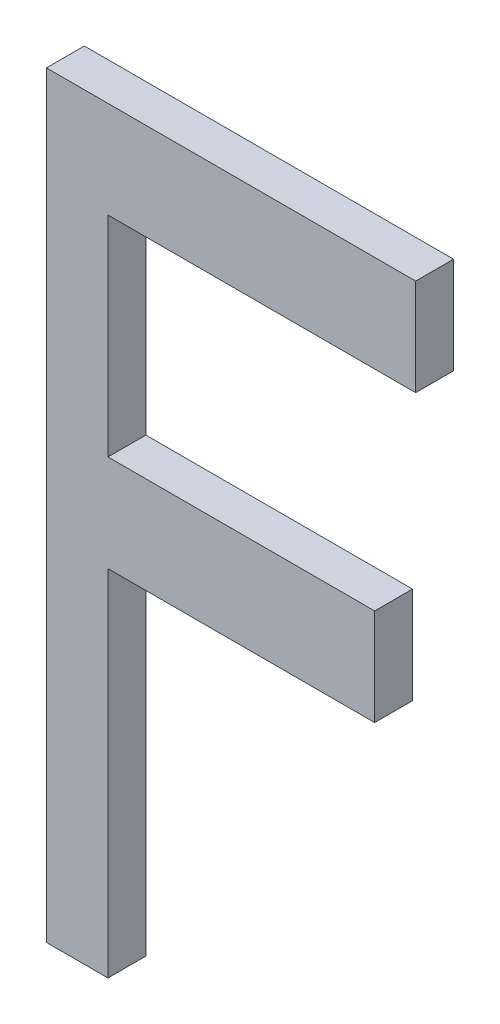
ISO-10303-21;
HEADER;
FILE_DESCRIPTION(('STEP AP214'),'2;1');
FILE_NAME('part.step','',(''),(''),'','','');
FILE_SCHEMA(('AUTOMOTIVE_DESIGN { 1 0 10303 214 1 1 1 1 }'));
ENDSEC;
DATA;
#1=APPLICATION_CONTEXT('core data for automotive mechanical design processes');
#2=APPLICATION_PROTOCOL_DEFINITION('international standard','automotive_design',2000,#1);
#3=PRODUCT_CONTEXT('',#1,'mechanical');
#4=PRODUCT('Part','Part','',(#3));
#5=PRODUCT_RELATED_PRODUCT_CATEGORY('part','',(#4));
#6=PRODUCT_DEFINITION_FORMATION('','',#4);
#7=PRODUCT_DEFINITION_CONTEXT('part definition',#1,'design');
#8=PRODUCT_DEFINITION('design','',#6,#7);
#9=PRODUCT_DEFINITION_SHAPE('','',#8);
#10=(LENGTH_UNIT() NAMED_UNIT(*) SI_UNIT(.MILLI.,.METRE.));
#11=(NAMED_UNIT(*) PLANE_ANGLE_UNIT() SI_UNIT($,.RADIAN.));
#12=(NAMED_UNIT(*) SI_UNIT($,.STERADIAN.) SOLID_ANGLE_UNIT());
#13=UNCERTAINTY_MEASURE_WITH_UNIT(LENGTH_MEASURE(1.E-05),#10,'distance_accuracy_value','');
#14=(GEOMETRIC_REPRESENTATION_CONTEXT(3) GLOBAL_UNCERTAINTY_ASSIGNED_CONTEXT((#13)) GLOBAL_UNIT_ASSIGNED_CONTEXT((#10,
#11,#12)) REPRESENTATION_CONTEXT('',''));
#15=CARTESIAN_POINT('',(0.,0.,0.));
#16=DIRECTION('',(0.,0.,1.));
#17=DIRECTION('',(1.,0.,0.));
#18=AXIS2_PLACEMENT_3D('',#15,#16,#17);
#19=CARTESIAN_POINT('',(109.664831113507,28.2906710184783,5.9));
#20=DIRECTION('',(0.,0.,1.));
#21=DIRECTION('',(1.,0.,0.));
#22=AXIS2_PLACEMENT_3D('',#19,#20,#21);
#23=PLANE('',#22);
#24=DIRECTION('',(1.,0.,0.));
#25=VECTOR('',#24,1.);
#26=CARTESIAN_POINT('',(109.664831113507,30.2906710184783,5.9));
#27=LINE('',#26,#25);
#28=CARTESIAN_POINT('',(110.639831113507,30.2906710184783,5.9));
#29=VERTEX_POINT('',#28);
#30=CARTESIAN_POINT('',(109.664831113507,30.2906710184783,5.9));
#31=VERTEX_POINT('',#30);
#32=EDGE_CURVE('E126',#29,#31,#27,.F.);
#33=ORIENTED_EDGE('',*,*,#32,.F.);
#34=DIRECTION('',(0.,1.,0.));
#35=VECTOR('',#34,1.);
#36=CARTESIAN_POINT('',(110.639831113507,28.2906710184783,5.9));
#37=LINE('',#36,#35);
#38=CARTESIAN_POINT('',(110.639831113507,30.0353518999783,5.9));
#39=VERTEX_POINT('',#38);
#40=EDGE_CURVE('E124',#39,#29,#37,.T.);
#41=ORIENTED_EDGE('',*,*,#40,.F.);
#42=DIRECTION('',(1.,0.,0.));
#43=VECTOR('',#42,1.);
#44=CARTESIAN_POINT('',(109.664831113507,30.0353518999783,5.9));
#45=LINE('',#44,#43);
#46=CARTESIAN_POINT('',(109.827331113507,30.0353518999783,5.9));
#47=VERTEX_POINT('',#46);
#48=EDGE_CURVE('E122',#47,#39,#45,.T.);
#49=ORIENTED_EDGE('',*,*,#48,.F.);
#50=DIRECTION('',(0.,1.,0.));
#51=VECTOR('',#50,1.);
#52=CARTESIAN_POINT('',(109.827331113507,28.2906710184783,5.9));
#53=LINE('',#52,#51);
#54=CARTESIAN_POINT('',(109.827331113507,29.4821603573583,5.9));
#55=VERTEX_POINT('',#54);
#56=EDGE_CURVE('E120',#55,#47,#53,.T.);
#57=ORIENTED_EDGE('',*,*,#56,.F.);
#58=DIRECTION('',(1.,0.,0.));
#59=VECTOR('',#58,1.);
#60=CARTESIAN_POINT('',(109.664831113507,29.4821603573583,5.9));
#61=LINE('',#60,#59);
#62=CARTESIAN_POINT('',(110.531497806007,29.4821603573583,5.9));
#63=VERTEX_POINT('',#62);
#64=EDGE_CURVE('E118',#63,#55,#61,.F.);
#65=ORIENTED_EDGE('',*,*,#64,.F.);
#66=DIRECTION('',(0.,1.,0.));
#67=VECTOR('',#66,1.);
#68=CARTESIAN_POINT('',(110.531497806007,28.2906710184783,5.9));
#69=LINE('',#68,#67);
#70=CARTESIAN_POINT('',(110.531497806007,29.2268412388583,5.9));
#71=VERTEX_POINT('',#70);
#72=EDGE_CURVE('E114',#71,#63,#69,.T.);
#73=ORIENTED_EDGE('',*,*,#72,.F.);
#74=DIRECTION('',(1.,0.,0.));
#75=VECTOR('',#74,1.);
#76=CARTESIAN_POINT('',(109.664831113507,29.2268412388583,5.9));
#77=LINE('',#76,#75);
#78=CARTESIAN_POINT('',(109.827331113507,29.2268412388583,5.9));
#79=VERTEX_POINT('',#78);
#80=EDGE_CURVE('E113',#79,#71,#77,.T.);
#81=ORIENTED_EDGE('',*,*,#80,.F.);
#82=DIRECTION('',(0.,1.,0.));
#83=VECTOR('',#82,1.);
#84=CARTESIAN_POINT('',(109.827331113507,28.2906710184783,5.9));
#85=LINE('',#84,#83);
#86=CARTESIAN_POINT('',(109.827331113507,28.2906710184783,5.9));
#87=VERTEX_POINT('',#86);
#88=EDGE_CURVE('E91',#87,#79,#85,.T.);
#89=ORIENTED_EDGE('',*,*,#88,.F.);
#90=DIRECTION('',(1.,0.,0.));
#91=VECTOR('',#90,1.);
#92=CARTESIAN_POINT('',(109.664831113507,28.2906710184783,5.9));
#93=LINE('',#92,#91);
#94=CARTESIAN_POINT('',(109.664831113507,28.2906710184783,5.9));
#95=VERTEX_POINT('',#94);
#96=EDGE_CURVE('E20',#95,#87,#93,.T.);
#97=ORIENTED_EDGE('',*,*,#96,.F.);
#98=DIRECTION('',(0.,1.,0.));
#99=VECTOR('',#98,1.);
#100=CARTESIAN_POINT('',(109.664831113507,30.2906710184783,5.9));
#101=LINE('',#100,#99);
#102=EDGE_CURVE('E128',#95,#31,#101,.T.);
#103=ORIENTED_EDGE('',*,*,#102,.T.);
#104=EDGE_LOOP('',(#33,#41,#49,#57,#65,#73,#81,#89,#97,#103));
#105=FACE_BOUND('',#104,.T.);
#106=ADVANCED_FACE('F17',(#105),#23,.F.);
#107=CARTESIAN_POINT('',(109.664831113507,30.2906710184783,6.));
#108=DIRECTION('',(1.,0.,0.));
#109=DIRECTION('',(0.,0.,-1.));
#110=AXIS2_PLACEMENT_3D('',#107,#108,#109);
#111=PLANE('',#110);
#112=DIRECTION('',(0.,0.,1.));
#113=VECTOR('',#112,1.);
#114=CARTESIAN_POINT('',(109.664831113507,28.2906710184783,6.));
#115=LINE('',#114,#113);
#116=CARTESIAN_POINT('',(109.664831113507,28.2906710184783,6.));
#117=VERTEX_POINT('',#116);
#118=EDGE_CURVE('E100',#95,#117,#115,.T.);
#119=ORIENTED_EDGE('',*,*,#118,.T.);
#120=DIRECTION('',(0.,1.,0.));
#121=VECTOR('',#120,1.);
#122=CARTESIAN_POINT('',(109.664831113507,28.2906710184783,6.));
#123=LINE('',#122,#121);
#124=CARTESIAN_POINT('',(109.664831113507,30.2906710184783,6.));
#125=VERTEX_POINT('',#124);
#126=EDGE_CURVE('E146',#125,#117,#123,.F.);
#127=ORIENTED_EDGE('',*,*,#126,.F.);
#128=DIRECTION('',(0.,0.,-1.));
#129=VECTOR('',#128,1.);
#130=CARTESIAN_POINT('',(109.664831113507,30.2906710184783,6.));
#131=LINE('',#130,#129);
#132=EDGE_CURVE('E143',#125,#31,#131,.T.);
#133=ORIENTED_EDGE('',*,*,#132,.T.);
#134=ORIENTED_EDGE('',*,*,#102,.F.);
#135=EDGE_LOOP('',(#119,#127,#133,#134));
#136=FACE_BOUND('',#135,.T.);
#137=ADVANCED_FACE('F181',(#136),#111,.F.);
#138=CARTESIAN_POINT('',(109.664831113507,28.2906710184783,6.));
#139=DIRECTION('',(0.,1.,0.));
#140=DIRECTION('',(0.,0.,1.));
#141=AXIS2_PLACEMENT_3D('',#138,#139,#140);
#142=PLANE('',#141);
#143=DIRECTION('',(0.,0.,1.));
#144=VECTOR('',#143,1.);
#145=CARTESIAN_POINT('',(109.827331113507,28.2906710184783,6.));
#146=LINE('',#145,#144);
#147=CARTESIAN_POINT('',(109.827331113507,28.2906710184783,6.));
#148=VERTEX_POINT('',#147);
#149=EDGE_CURVE('E98',#87,#148,#146,.T.);
#150=ORIENTED_EDGE('',*,*,#149,.T.);
#151=DIRECTION('',(1.,0.,0.));
#152=VECTOR('',#151,1.);
#153=CARTESIAN_POINT('',(109.664831113507,28.2906710184783,6.));
#154=LINE('',#153,#152);
#155=EDGE_CURVE('E149',#117,#148,#154,.T.);
#156=ORIENTED_EDGE('',*,*,#155,.F.);
#157=ORIENTED_EDGE('',*,*,#118,.F.);
#158=ORIENTED_EDGE('',*,*,#96,.T.);
#159=EDGE_LOOP('',(#150,#156,#157,#158));
#160=FACE_BOUND('',#159,.T.);
#161=ADVANCED_FACE('F96',(#160),#142,.F.);
#162=CARTESIAN_POINT('',(109.827331113507,28.2906710184783,6.));
#163=DIRECTION('',(-1.,0.,0.));
#164=DIRECTION('',(0.,0.,1.));
#165=AXIS2_PLACEMENT_3D('',#162,#163,#164);
#166=PLANE('',#165);
#167=DIRECTION('',(0.,0.,1.));
#168=VECTOR('',#167,1.);
#169=CARTESIAN_POINT('',(109.827331113507,29.2268412388583,6.));
#170=LINE('',#169,#168);
#171=CARTESIAN_POINT('',(109.827331113507,29.2268412388583,6.));
#172=VERTEX_POINT('',#171);
#173=EDGE_CURVE('E108',#79,#172,#170,.T.);
#174=ORIENTED_EDGE('',*,*,#173,.T.);
#175=DIRECTION('',(0.,1.,0.));
#176=VECTOR('',#175,1.);
#177=CARTESIAN_POINT('',(109.827331113507,28.2906710184783,6.));
#178=LINE('',#177,#176);
#179=EDGE_CURVE('E106',#148,#172,#178,.T.);
#180=ORIENTED_EDGE('',*,*,#179,.F.);
#181=ORIENTED_EDGE('',*,*,#149,.F.);
#182=ORIENTED_EDGE('',*,*,#88,.T.);
#183=EDGE_LOOP('',(#174,#180,#181,#182));
#184=FACE_BOUND('',#183,.T.);
#185=ADVANCED_FACE('F104',(#184),#166,.F.);
#186=CARTESIAN_POINT('',(109.827331113507,29.2268412388583,6.));
#187=DIRECTION('',(0.,1.,0.));
#188=DIRECTION('',(0.,0.,1.));
#189=AXIS2_PLACEMENT_3D('',#186,#187,#188);
#190=PLANE('',#189);
#191=DIRECTION('',(0.,0.,1.));
#192=VECTOR('',#191,1.);
#193=CARTESIAN_POINT('',(110.531497806007,29.2268412388583,6.));
#194=LINE('',#193,#192);
#195=CARTESIAN_POINT('',(110.531497806007,29.2268412388583,6.));
#196=VERTEX_POINT('',#195);
#197=EDGE_CURVE('E132',#71,#196,#194,.T.);
#198=ORIENTED_EDGE('',*,*,#197,.T.);
#199=DIRECTION('',(1.,0.,0.));
#200=VECTOR('',#199,1.);
#201=CARTESIAN_POINT('',(109.664831113507,29.2268412388583,6.));
#202=LINE('',#201,#200);
#203=EDGE_CURVE('E152',#172,#196,#202,.T.);
#204=ORIENTED_EDGE('',*,*,#203,.F.);
#205=ORIENTED_EDGE('',*,*,#173,.F.);
#206=ORIENTED_EDGE('',*,*,#80,.T.);
#207=EDGE_LOOP('',(#198,#204,#205,#206));
#208=FACE_BOUND('',#207,.T.);
#209=ADVANCED_FACE('F185',(#208),#190,.F.);
#210=CARTESIAN_POINT('',(110.531497806007,29.2268412388583,6.));
#211=DIRECTION('',(-1.,0.,0.));
#212=DIRECTION('',(0.,0.,1.));
#213=AXIS2_PLACEMENT_3D('',#210,#211,#212);
#214=PLANE('',#213);
#215=DIRECTION('',(0.,0.,-1.));
#216=VECTOR('',#215,1.);
#217=CARTESIAN_POINT('',(110.531497806007,29.4821603573583,6.));
#218=LINE('',#217,#216);
#219=CARTESIAN_POINT('',(110.531497806007,29.4821603573583,6.));
#220=VERTEX_POINT('',#219);
#221=EDGE_CURVE('E134',#63,#220,#218,.F.);
#222=ORIENTED_EDGE('',*,*,#221,.T.);
#223=DIRECTION('',(0.,1.,0.));
#224=VECTOR('',#223,1.);
#225=CARTESIAN_POINT('',(110.531497806007,28.2906710184783,6.));
#226=LINE('',#225,#224);
#227=EDGE_CURVE('E155',#196,#220,#226,.T.);
#228=ORIENTED_EDGE('',*,*,#227,.F.);
#229=ORIENTED_EDGE('',*,*,#197,.F.);
#230=ORIENTED_EDGE('',*,*,#72,.T.);
#231=EDGE_LOOP('',(#222,#228,#229,#230));
#232=FACE_BOUND('',#231,.T.);
#233=ADVANCED_FACE('F188',(#232),#214,.F.);
#234=CARTESIAN_POINT('',(110.531497806007,29.4821603573583,6.));
#235=DIRECTION('',(0.,-1.,0.));
#236=DIRECTION('',(0.,0.,-1.));
#237=AXIS2_PLACEMENT_3D('',#234,#235,#236);
#238=PLANE('',#237);
#239=DIRECTION('',(0.,0.,1.));
#240=VECTOR('',#239,1.);
#241=CARTESIAN_POINT('',(109.827331113507,29.4821603573583,6.));
#242=LINE('',#241,#240);
#243=CARTESIAN_POINT('',(109.827331113507,29.4821603573583,6.));
#244=VERTEX_POINT('',#243);
#245=EDGE_CURVE('E136',#55,#244,#242,.T.);
#246=ORIENTED_EDGE('',*,*,#245,.T.);
#247=DIRECTION('',(1.,0.,0.));
#248=VECTOR('',#247,1.);
#249=CARTESIAN_POINT('',(109.664831113507,29.4821603573583,6.));
#250=LINE('',#249,#248);
#251=EDGE_CURVE('E158',#220,#244,#250,.F.);
#252=ORIENTED_EDGE('',*,*,#251,.F.);
#253=ORIENTED_EDGE('',*,*,#221,.F.);
#254=ORIENTED_EDGE('',*,*,#64,.T.);
#255=EDGE_LOOP('',(#246,#252,#253,#254));
#256=FACE_BOUND('',#255,.T.);
#257=ADVANCED_FACE('F193',(#256),#238,.F.);
#258=CARTESIAN_POINT('',(109.827331113507,29.4821603573583,6.));
#259=DIRECTION('',(-1.,0.,0.));
#260=DIRECTION('',(0.,0.,1.));
#261=AXIS2_PLACEMENT_3D('',#258,#259,#260);
#262=PLANE('',#261);
#263=DIRECTION('',(0.,0.,1.));
#264=VECTOR('',#263,1.);
#265=CARTESIAN_POINT('',(109.827331113507,30.0353518999783,6.));
#266=LINE('',#265,#264);
#267=CARTESIAN_POINT('',(109.827331113507,30.0353518999783,6.));
#268=VERTEX_POINT('',#267);
#269=EDGE_CURVE('E138',#47,#268,#266,.T.);
#270=ORIENTED_EDGE('',*,*,#269,.T.);
#271=DIRECTION('',(0.,1.,0.));
#272=VECTOR('',#271,1.);
#273=CARTESIAN_POINT('',(109.827331113507,28.2906710184783,6.));
#274=LINE('',#273,#272);
#275=EDGE_CURVE('E161',#244,#268,#274,.T.);
#276=ORIENTED_EDGE('',*,*,#275,.F.);
#277=ORIENTED_EDGE('',*,*,#245,.F.);
#278=ORIENTED_EDGE('',*,*,#56,.T.);
#279=EDGE_LOOP('',(#270,#276,#277,#278));
#280=FACE_BOUND('',#279,.T.);
#281=ADVANCED_FACE('F197',(#280),#262,.F.);
#282=CARTESIAN_POINT('',(109.827331113507,30.0353518999783,6.));
#283=DIRECTION('',(0.,1.,0.));
#284=DIRECTION('',(0.,0.,1.));
#285=AXIS2_PLACEMENT_3D('',#282,#283,#284);
#286=PLANE('',#285);
#287=DIRECTION('',(0.,0.,1.));
#288=VECTOR('',#287,1.);
#289=CARTESIAN_POINT('',(110.639831113507,30.0353518999783,6.));
#290=LINE('',#289,#288);
#291=CARTESIAN_POINT('',(110.639831113507,30.0353518999783,6.));
#292=VERTEX_POINT('',#291);
#293=EDGE_CURVE('E140',#39,#292,#290,.T.);
#294=ORIENTED_EDGE('',*,*,#293,.T.);
#295=DIRECTION('',(1.,0.,0.));
#296=VECTOR('',#295,1.);
#297=CARTESIAN_POINT('',(109.664831113507,30.0353518999783,6.));
#298=LINE('',#297,#296);
#299=EDGE_CURVE('E164',#268,#292,#298,.T.);
#300=ORIENTED_EDGE('',*,*,#299,.F.);
#301=ORIENTED_EDGE('',*,*,#269,.F.);
#302=ORIENTED_EDGE('',*,*,#48,.T.);
#303=EDGE_LOOP('',(#294,#300,#301,#302));
#304=FACE_BOUND('',#303,.T.);
#305=ADVANCED_FACE('F199',(#304),#286,.F.);
#306=CARTESIAN_POINT('',(110.639831113507,30.0353518999783,6.));
#307=DIRECTION('',(-1.,0.,0.));
#308=DIRECTION('',(0.,0.,1.));
#309=AXIS2_PLACEMENT_3D('',#306,#307,#308);
#310=PLANE('',#309);
#311=DIRECTION('',(0.,0.,-1.));
#312=VECTOR('',#311,1.);
#313=CARTESIAN_POINT('',(110.639831113507,30.2906710184783,6.));
#314=LINE('',#313,#312);
#315=CARTESIAN_POINT('',(110.639831113507,30.2906710184783,6.));
#316=VERTEX_POINT('',#315);
#317=EDGE_CURVE('E35',#29,#316,#314,.F.);
#318=ORIENTED_EDGE('',*,*,#317,.T.);
#319=DIRECTION('',(0.,1.,0.));
#320=VECTOR('',#319,1.);
#321=CARTESIAN_POINT('',(110.639831113507,28.2906710184783,6.));
#322=LINE('',#321,#320);
#323=EDGE_CURVE('E26',#292,#316,#322,.T.);
#324=ORIENTED_EDGE('',*,*,#323,.F.);
#325=ORIENTED_EDGE('',*,*,#293,.F.);
#326=ORIENTED_EDGE('',*,*,#40,.T.);
#327=EDGE_LOOP('',(#318,#324,#325,#326));
#328=FACE_BOUND('',#327,.T.);
#329=ADVANCED_FACE('F172',(#328),#310,.F.);
#330=CARTESIAN_POINT('',(110.639831113507,30.2906710184783,6.));
#331=DIRECTION('',(0.,-1.,0.));
#332=DIRECTION('',(0.,0.,-1.));
#333=AXIS2_PLACEMENT_3D('',#330,#331,#332);
#334=PLANE('',#333);
#335=ORIENTED_EDGE('',*,*,#132,.F.);
#336=DIRECTION('',(1.,0.,0.));
#337=VECTOR('',#336,1.);
#338=CARTESIAN_POINT('',(109.664831113507,30.2906710184783,6.));
#339=LINE('',#338,#337);
#340=EDGE_CURVE('E11',#316,#125,#339,.F.);
#341=ORIENTED_EDGE('',*,*,#340,.F.);
#342=ORIENTED_EDGE('',*,*,#317,.F.);
#343=ORIENTED_EDGE('',*,*,#32,.T.);
#344=EDGE_LOOP('',(#335,#341,#342,#343));
#345=FACE_BOUND('',#344,.T.);
#346=ADVANCED_FACE('F179',(#345),#334,.F.);
#347=CARTESIAN_POINT('',(109.664831113507,28.2906710184783,6.));
#348=DIRECTION('',(0.,0.,1.));
#349=DIRECTION('',(1.,0.,0.));
#350=AXIS2_PLACEMENT_3D('',#347,#348,#349);
#351=PLANE('',#350);
#352=ORIENTED_EDGE('',*,*,#323,.T.);
#353=ORIENTED_EDGE('',*,*,#340,.T.);
#354=ORIENTED_EDGE('',*,*,#126,.T.);
#355=ORIENTED_EDGE('',*,*,#155,.T.);
#356=ORIENTED_EDGE('',*,*,#179,.T.);
#357=ORIENTED_EDGE('',*,*,#203,.T.);
#358=ORIENTED_EDGE('',*,*,#227,.T.);
#359=ORIENTED_EDGE('',*,*,#251,.T.);
#360=ORIENTED_EDGE('',*,*,#275,.T.);
#361=ORIENTED_EDGE('',*,*,#299,.T.);
#362=EDGE_LOOP('',(#352,#353,#354,#355,#356,#357,#358,#359,#360,#361));
#363=FACE_BOUND('',#362,.T.);
#364=ADVANCED_FACE('F169',(#363),#351,.T.);
#365=CLOSED_SHELL('',(#106,#137,#161,#185,#209,#233,#257,#281,#305,#329,#346,#364));
#366=MANIFOLD_SOLID_BREP('B1',#365);
#367=ADVANCED_BREP_SHAPE_REPRESENTATION('',(#18,#366),#14);
#368=SHAPE_DEFINITION_REPRESENTATION(#9,#367);
ENDSEC;
END-ISO-10303-21;
